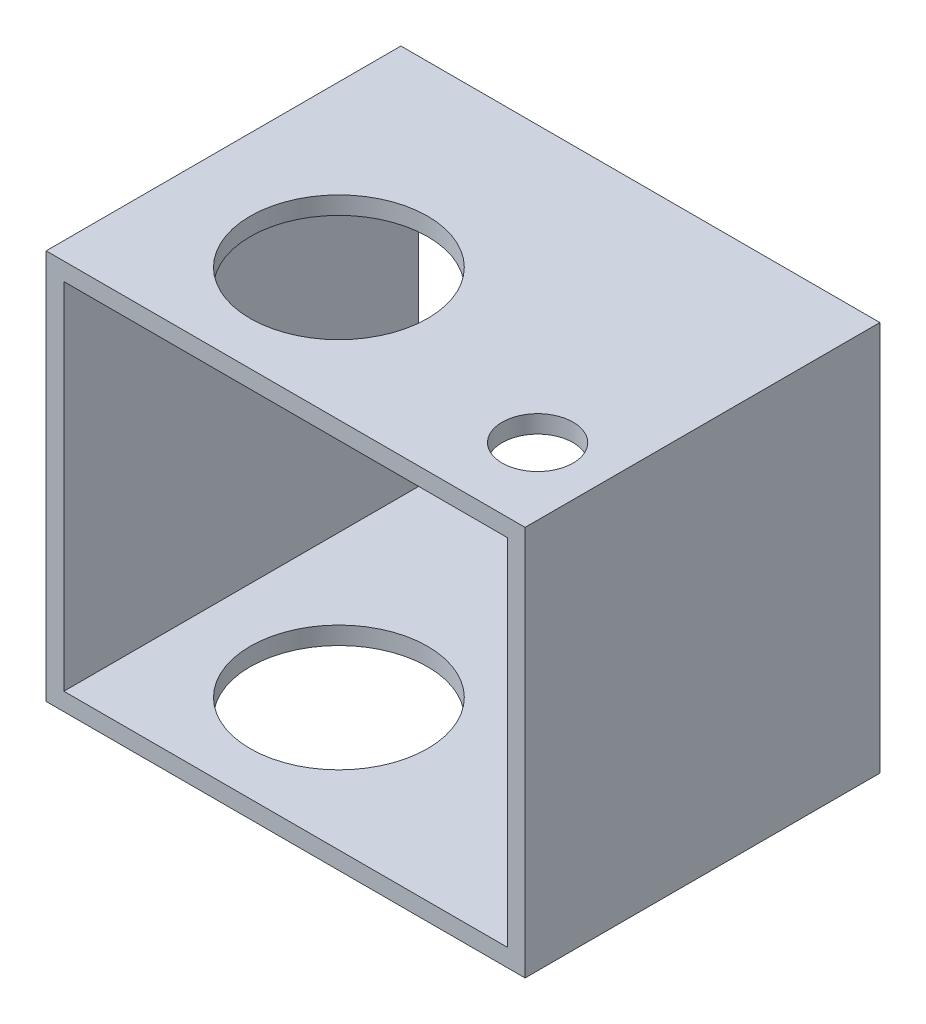
ISO-10303-21;
HEADER;
FILE_DESCRIPTION(('STEP AP214'),'2;1');
FILE_NAME('part.step','',(''),(''),'','','');
FILE_SCHEMA(('AUTOMOTIVE_DESIGN { 1 0 10303 214 1 1 1 1 }'));
ENDSEC;
DATA;
#1=APPLICATION_CONTEXT('core data for automotive mechanical design processes');
#2=APPLICATION_PROTOCOL_DEFINITION('international standard','automotive_design',2000,#1);
#3=PRODUCT_CONTEXT('',#1,'mechanical');
#4=PRODUCT('Part','Part','',(#3));
#5=PRODUCT_RELATED_PRODUCT_CATEGORY('part','',(#4));
#6=PRODUCT_DEFINITION_FORMATION('','',#4);
#7=PRODUCT_DEFINITION_CONTEXT('part definition',#1,'design');
#8=PRODUCT_DEFINITION('design','',#6,#7);
#9=PRODUCT_DEFINITION_SHAPE('','',#8);
#10=(LENGTH_UNIT() NAMED_UNIT(*) SI_UNIT(.MILLI.,.METRE.));
#11=(NAMED_UNIT(*) PLANE_ANGLE_UNIT() SI_UNIT($,.RADIAN.));
#12=(NAMED_UNIT(*) SI_UNIT($,.STERADIAN.) SOLID_ANGLE_UNIT());
#13=UNCERTAINTY_MEASURE_WITH_UNIT(LENGTH_MEASURE(1.E-05),#10,'distance_accuracy_value','');
#14=(GEOMETRIC_REPRESENTATION_CONTEXT(3) GLOBAL_UNCERTAINTY_ASSIGNED_CONTEXT((#13)) GLOBAL_UNIT_ASSIGNED_CONTEXT((#10,
#11,#12)) REPRESENTATION_CONTEXT('',''));
#15=CARTESIAN_POINT('',(0.,0.,0.));
#16=DIRECTION('',(0.,0.,1.));
#17=DIRECTION('',(1.,0.,0.));
#18=AXIS2_PLACEMENT_3D('',#15,#16,#17);
#19=CARTESIAN_POINT('',(0.,0.,20.));
#20=DIRECTION('',(0.,0.,1.));
#21=DIRECTION('',(1.,0.,0.));
#22=AXIS2_PLACEMENT_3D('',#19,#20,#21);
#23=PLANE('',#22);
#24=DIRECTION('',(0.,1.,0.));
#25=VECTOR('',#24,1.);
#26=CARTESIAN_POINT('',(1.,0.,20.));
#27=LINE('',#26,#25);
#28=CARTESIAN_POINT('',(1.,-1.,20.));
#29=VERTEX_POINT('',#28);
#30=CARTESIAN_POINT('',(1.,21.,20.));
#31=VERTEX_POINT('',#30);
#32=EDGE_CURVE('E162',#29,#31,#27,.T.);
#33=ORIENTED_EDGE('',*,*,#32,.T.);
#34=DIRECTION('',(-1.,0.,0.));
#35=VECTOR('',#34,1.);
#36=CARTESIAN_POINT('',(0.,21.,20.));
#37=LINE('',#36,#35);
#38=CARTESIAN_POINT('',(-26.,21.,20.));
#39=VERTEX_POINT('',#38);
#40=EDGE_CURVE('E165',#31,#39,#37,.T.);
#41=ORIENTED_EDGE('',*,*,#40,.T.);
#42=DIRECTION('',(0.,-1.,0.));
#43=VECTOR('',#42,1.);
#44=CARTESIAN_POINT('',(-26.,0.,20.));
#45=LINE('',#44,#43);
#46=CARTESIAN_POINT('',(-26.,-1.,20.));
#47=VERTEX_POINT('',#46);
#48=EDGE_CURVE('E168',#39,#47,#45,.T.);
#49=ORIENTED_EDGE('',*,*,#48,.T.);
#50=DIRECTION('',(1.,0.,0.));
#51=VECTOR('',#50,1.);
#52=CARTESIAN_POINT('',(0.,-1.,20.));
#53=LINE('',#52,#51);
#54=EDGE_CURVE('E170',#47,#29,#53,.T.);
#55=ORIENTED_EDGE('',*,*,#54,.T.);
#56=EDGE_LOOP('',(#33,#41,#49,#55));
#57=FACE_BOUND('',#56,.T.);
#58=DIRECTION('',(-1.,0.,0.));
#59=VECTOR('',#58,1.);
#60=CARTESIAN_POINT('',(0.,20.,20.));
#61=LINE('',#60,#59);
#62=CARTESIAN_POINT('',(0.,20.,20.));
#63=VERTEX_POINT('',#62);
#64=CARTESIAN_POINT('',(-25.,20.,20.));
#65=VERTEX_POINT('',#64);
#66=EDGE_CURVE('E132',#63,#65,#61,.T.);
#67=ORIENTED_EDGE('',*,*,#66,.F.);
#68=DIRECTION('',(0.,1.,0.));
#69=VECTOR('',#68,1.);
#70=CARTESIAN_POINT('',(0.,0.,20.));
#71=LINE('',#70,#69);
#72=CARTESIAN_POINT('',(0.,0.,20.));
#73=VERTEX_POINT('',#72);
#74=EDGE_CURVE('E124',#73,#63,#71,.T.);
#75=ORIENTED_EDGE('',*,*,#74,.F.);
#76=DIRECTION('',(1.,0.,0.));
#77=VECTOR('',#76,1.);
#78=CARTESIAN_POINT('',(0.,0.,20.));
#79=LINE('',#78,#77);
#80=CARTESIAN_POINT('',(-25.,0.,20.));
#81=VERTEX_POINT('',#80);
#82=EDGE_CURVE('E146',#81,#73,#79,.T.);
#83=ORIENTED_EDGE('',*,*,#82,.F.);
#84=DIRECTION('',(0.,-1.,0.));
#85=VECTOR('',#84,1.);
#86=CARTESIAN_POINT('',(-25.,0.,20.));
#87=LINE('',#86,#85);
#88=EDGE_CURVE('E144',#65,#81,#87,.T.);
#89=ORIENTED_EDGE('',*,*,#88,.F.);
#90=EDGE_LOOP('',(#67,#75,#83,#89));
#91=FACE_BOUND('',#90,.T.);
#92=ADVANCED_FACE('F57',(#57,#91),#23,.T.);
#93=CARTESIAN_POINT('',(0.,0.,0.));
#94=DIRECTION('',(0.,0.,1.));
#95=DIRECTION('',(1.,0.,0.));
#96=AXIS2_PLACEMENT_3D('',#93,#94,#95);
#97=PLANE('',#96);
#98=DIRECTION('',(0.,1.,0.));
#99=VECTOR('',#98,1.);
#100=CARTESIAN_POINT('',(1.,0.,0.));
#101=LINE('',#100,#99);
#102=CARTESIAN_POINT('',(1.,-1.,0.));
#103=VERTEX_POINT('',#102);
#104=CARTESIAN_POINT('',(1.,21.,0.));
#105=VERTEX_POINT('',#104);
#106=EDGE_CURVE('E140',#103,#105,#101,.T.);
#107=ORIENTED_EDGE('',*,*,#106,.F.);
#108=DIRECTION('',(1.,0.,0.));
#109=VECTOR('',#108,1.);
#110=CARTESIAN_POINT('',(0.,-1.,0.));
#111=LINE('',#110,#109);
#112=CARTESIAN_POINT('',(-26.,-1.,0.));
#113=VERTEX_POINT('',#112);
#114=EDGE_CURVE('E166',#113,#103,#111,.T.);
#115=ORIENTED_EDGE('',*,*,#114,.F.);
#116=DIRECTION('',(0.,-1.,0.));
#117=VECTOR('',#116,1.);
#118=CARTESIAN_POINT('',(-26.,0.,0.));
#119=LINE('',#118,#117);
#120=CARTESIAN_POINT('',(-26.,21.,0.));
#121=VERTEX_POINT('',#120);
#122=EDGE_CURVE('E177',#121,#113,#119,.T.);
#123=ORIENTED_EDGE('',*,*,#122,.F.);
#124=DIRECTION('',(-1.,0.,0.));
#125=VECTOR('',#124,1.);
#126=CARTESIAN_POINT('',(0.,21.,0.));
#127=LINE('',#126,#125);
#128=EDGE_CURVE('E175',#105,#121,#127,.T.);
#129=ORIENTED_EDGE('',*,*,#128,.F.);
#130=EDGE_LOOP('',(#107,#115,#123,#129));
#131=FACE_BOUND('',#130,.T.);
#132=DIRECTION('',(0.,1.,0.));
#133=VECTOR('',#132,1.);
#134=CARTESIAN_POINT('',(0.,0.,0.));
#135=LINE('',#134,#133);
#136=CARTESIAN_POINT('',(0.,0.,0.));
#137=VERTEX_POINT('',#136);
#138=CARTESIAN_POINT('',(0.,20.,0.));
#139=VERTEX_POINT('',#138);
#140=EDGE_CURVE('E82',#137,#139,#135,.T.);
#141=ORIENTED_EDGE('',*,*,#140,.T.);
#142=DIRECTION('',(-1.,0.,0.));
#143=VECTOR('',#142,1.);
#144=CARTESIAN_POINT('',(0.,20.,0.));
#145=LINE('',#144,#143);
#146=CARTESIAN_POINT('',(-25.,20.,0.));
#147=VERTEX_POINT('',#146);
#148=EDGE_CURVE('E139',#139,#147,#145,.T.);
#149=ORIENTED_EDGE('',*,*,#148,.T.);
#150=DIRECTION('',(0.,-1.,0.));
#151=VECTOR('',#150,1.);
#152=CARTESIAN_POINT('',(-25.,0.,0.));
#153=LINE('',#152,#151);
#154=CARTESIAN_POINT('',(-25.,0.,0.));
#155=VERTEX_POINT('',#154);
#156=EDGE_CURVE('E154',#147,#155,#153,.T.);
#157=ORIENTED_EDGE('',*,*,#156,.T.);
#158=DIRECTION('',(1.,0.,0.));
#159=VECTOR('',#158,1.);
#160=CARTESIAN_POINT('',(0.,0.,0.));
#161=LINE('',#160,#159);
#162=EDGE_CURVE('E133',#155,#137,#161,.T.);
#163=ORIENTED_EDGE('',*,*,#162,.T.);
#164=EDGE_LOOP('',(#141,#149,#157,#163));
#165=FACE_BOUND('',#164,.T.);
#166=ADVANCED_FACE('F236',(#131,#165),#97,.F.);
#167=CARTESIAN_POINT('',(1.,0.,20.));
#168=DIRECTION('',(-1.,0.,0.));
#169=DIRECTION('',(0.,0.,1.));
#170=AXIS2_PLACEMENT_3D('',#167,#168,#169);
#171=PLANE('',#170);
#172=ORIENTED_EDGE('',*,*,#106,.T.);
#173=DIRECTION('',(0.,0.,-1.));
#174=VECTOR('',#173,1.);
#175=CARTESIAN_POINT('',(1.,21.,20.));
#176=LINE('',#175,#174);
#177=EDGE_CURVE('E12',#31,#105,#176,.T.);
#178=ORIENTED_EDGE('',*,*,#177,.F.);
#179=ORIENTED_EDGE('',*,*,#32,.F.);
#180=DIRECTION('',(0.,0.,-1.));
#181=VECTOR('',#180,1.);
#182=CARTESIAN_POINT('',(1.,-1.,20.));
#183=LINE('',#182,#181);
#184=EDGE_CURVE('E172',#29,#103,#183,.T.);
#185=ORIENTED_EDGE('',*,*,#184,.T.);
#186=EDGE_LOOP('',(#172,#178,#179,#185));
#187=FACE_BOUND('',#186,.T.);
#188=ADVANCED_FACE('F59',(#187),#171,.F.);
#189=CARTESIAN_POINT('',(0.,21.,20.));
#190=DIRECTION('',(0.,-1.,0.));
#191=DIRECTION('',(1.,0.,0.));
#192=AXIS2_PLACEMENT_3D('',#189,#190,#191);
#193=PLANE('',#192);
#194=CARTESIAN_POINT('',(-2.78489642997926,21.,15.5087196353438));
#195=DIRECTION('',(0.,1.,0.));
#196=DIRECTION('',(-1.,0.,0.));
#197=AXIS2_PLACEMENT_3D('',#194,#195,#196);
#198=CIRCLE('',#197,2.);
#199=CARTESIAN_POINT('',(-4.78489642997926,21.,15.5087196353438));
#200=VERTEX_POINT('',#199);
#201=EDGE_CURVE('E200',#200,#200,#198,.T.);
#202=ORIENTED_EDGE('',*,*,#201,.F.);
#203=EDGE_LOOP('',(#202));
#204=FACE_BOUND('',#203,.T.);
#205=CARTESIAN_POINT('',(-16.9444338680746,21.,12.5518280582246));
#206=DIRECTION('',(0.,1.,0.));
#207=DIRECTION('',(-1.,0.,0.));
#208=AXIS2_PLACEMENT_3D('',#205,#206,#207);
#209=CIRCLE('',#208,5.);
#210=CARTESIAN_POINT('',(-21.9444338680746,21.,12.5518280582246));
#211=VERTEX_POINT('',#210);
#212=EDGE_CURVE('E193',#211,#211,#209,.T.);
#213=ORIENTED_EDGE('',*,*,#212,.F.);
#214=EDGE_LOOP('',(#213));
#215=FACE_BOUND('',#214,.T.);
#216=ORIENTED_EDGE('',*,*,#128,.T.);
#217=DIRECTION('',(0.,0.,-1.));
#218=VECTOR('',#217,1.);
#219=CARTESIAN_POINT('',(-26.,21.,20.));
#220=LINE('',#219,#218);
#221=EDGE_CURVE('E66',#39,#121,#220,.T.);
#222=ORIENTED_EDGE('',*,*,#221,.F.);
#223=ORIENTED_EDGE('',*,*,#40,.F.);
#224=ORIENTED_EDGE('',*,*,#177,.T.);
#225=EDGE_LOOP('',(#216,#222,#223,#224));
#226=FACE_BOUND('',#225,.T.);
#227=ADVANCED_FACE('F222',(#204,#215,#226),#193,.F.);
#228=CARTESIAN_POINT('',(-26.,0.,20.));
#229=DIRECTION('',(1.,0.,0.));
#230=DIRECTION('',(0.,0.,-1.));
#231=AXIS2_PLACEMENT_3D('',#228,#229,#230);
#232=PLANE('',#231);
#233=ORIENTED_EDGE('',*,*,#122,.T.);
#234=DIRECTION('',(0.,0.,-1.));
#235=VECTOR('',#234,1.);
#236=CARTESIAN_POINT('',(-26.,-1.,20.));
#237=LINE('',#236,#235);
#238=EDGE_CURVE('E182',#47,#113,#237,.T.);
#239=ORIENTED_EDGE('',*,*,#238,.F.);
#240=ORIENTED_EDGE('',*,*,#48,.F.);
#241=ORIENTED_EDGE('',*,*,#221,.T.);
#242=EDGE_LOOP('',(#233,#239,#240,#241));
#243=FACE_BOUND('',#242,.T.);
#244=ADVANCED_FACE('F225',(#243),#232,.F.);
#245=CARTESIAN_POINT('',(0.,-1.,20.));
#246=DIRECTION('',(0.,1.,0.));
#247=DIRECTION('',(-1.,0.,0.));
#248=AXIS2_PLACEMENT_3D('',#245,#246,#247);
#249=PLANE('',#248);
#250=CARTESIAN_POINT('',(-16.9444338680746,-1.00000000000001,12.5518280582246));
#251=DIRECTION('',(0.,1.,0.));
#252=DIRECTION('',(-1.,0.,0.));
#253=AXIS2_PLACEMENT_3D('',#250,#251,#252);
#254=CIRCLE('',#253,5.);
#255=CARTESIAN_POINT('',(-21.9444338680746,-1.00000000000001,12.5518280582246));
#256=VERTEX_POINT('',#255);
#257=EDGE_CURVE('E188',#256,#256,#254,.T.);
#258=ORIENTED_EDGE('',*,*,#257,.T.);
#259=EDGE_LOOP('',(#258));
#260=FACE_BOUND('',#259,.T.);
#261=ORIENTED_EDGE('',*,*,#114,.T.);
#262=ORIENTED_EDGE('',*,*,#184,.F.);
#263=ORIENTED_EDGE('',*,*,#54,.F.);
#264=ORIENTED_EDGE('',*,*,#238,.T.);
#265=EDGE_LOOP('',(#261,#262,#263,#264));
#266=FACE_BOUND('',#265,.T.);
#267=ADVANCED_FACE('F240',(#260,#266),#249,.F.);
#268=CARTESIAN_POINT('',(0.,0.,20.));
#269=DIRECTION('',(-1.,0.,0.));
#270=DIRECTION('',(0.,0.,1.));
#271=AXIS2_PLACEMENT_3D('',#268,#269,#270);
#272=PLANE('',#271);
#273=ORIENTED_EDGE('',*,*,#140,.F.);
#274=DIRECTION('',(0.,0.,-1.));
#275=VECTOR('',#274,1.);
#276=CARTESIAN_POINT('',(0.,0.,20.));
#277=LINE('',#276,#275);
#278=EDGE_CURVE('E128',#73,#137,#277,.T.);
#279=ORIENTED_EDGE('',*,*,#278,.F.);
#280=ORIENTED_EDGE('',*,*,#74,.T.);
#281=DIRECTION('',(0.,0.,-1.));
#282=VECTOR('',#281,1.);
#283=CARTESIAN_POINT('',(0.,20.,20.));
#284=LINE('',#283,#282);
#285=EDGE_CURVE('E127',#63,#139,#284,.T.);
#286=ORIENTED_EDGE('',*,*,#285,.T.);
#287=EDGE_LOOP('',(#273,#279,#280,#286));
#288=FACE_BOUND('',#287,.T.);
#289=ADVANCED_FACE('F126',(#288),#272,.T.);
#290=CARTESIAN_POINT('',(0.,20.,20.));
#291=DIRECTION('',(0.,-1.,0.));
#292=DIRECTION('',(1.,0.,0.));
#293=AXIS2_PLACEMENT_3D('',#290,#291,#292);
#294=PLANE('',#293);
#295=CARTESIAN_POINT('',(-2.78489642997926,20.,15.5087196353438));
#296=DIRECTION('',(0.,-1.,0.));
#297=DIRECTION('',(1.,0.,0.));
#298=AXIS2_PLACEMENT_3D('',#295,#296,#297);
#299=CIRCLE('',#298,2.);
#300=CARTESIAN_POINT('',(-0.784896429979261,20.,15.5087196353438));
#301=VERTEX_POINT('',#300);
#302=EDGE_CURVE('E61',#301,#301,#299,.T.);
#303=ORIENTED_EDGE('',*,*,#302,.F.);
#304=EDGE_LOOP('',(#303));
#305=FACE_BOUND('',#304,.T.);
#306=CARTESIAN_POINT('',(-16.9444338680746,20.,12.5518280582246));
#307=DIRECTION('',(0.,-1.,0.));
#308=DIRECTION('',(1.,0.,0.));
#309=AXIS2_PLACEMENT_3D('',#306,#307,#308);
#310=CIRCLE('',#309,5.);
#311=CARTESIAN_POINT('',(-11.9444338680746,20.,12.5518280582246));
#312=VERTEX_POINT('',#311);
#313=EDGE_CURVE('E152',#312,#312,#310,.T.);
#314=ORIENTED_EDGE('',*,*,#313,.F.);
#315=EDGE_LOOP('',(#314));
#316=FACE_BOUND('',#315,.T.);
#317=ORIENTED_EDGE('',*,*,#148,.F.);
#318=ORIENTED_EDGE('',*,*,#285,.F.);
#319=ORIENTED_EDGE('',*,*,#66,.T.);
#320=DIRECTION('',(0.,0.,-1.));
#321=VECTOR('',#320,1.);
#322=CARTESIAN_POINT('',(-25.,20.,20.));
#323=LINE('',#322,#321);
#324=EDGE_CURVE('E141',#65,#147,#323,.T.);
#325=ORIENTED_EDGE('',*,*,#324,.T.);
#326=EDGE_LOOP('',(#317,#318,#319,#325));
#327=FACE_BOUND('',#326,.T.);
#328=ADVANCED_FACE('F136',(#305,#316,#327),#294,.T.);
#329=CARTESIAN_POINT('',(-25.,0.,20.));
#330=DIRECTION('',(1.,0.,0.));
#331=DIRECTION('',(0.,0.,-1.));
#332=AXIS2_PLACEMENT_3D('',#329,#330,#331);
#333=PLANE('',#332);
#334=ORIENTED_EDGE('',*,*,#156,.F.);
#335=ORIENTED_EDGE('',*,*,#324,.F.);
#336=ORIENTED_EDGE('',*,*,#88,.T.);
#337=DIRECTION('',(0.,0.,-1.));
#338=VECTOR('',#337,1.);
#339=CARTESIAN_POINT('',(-25.,0.,20.));
#340=LINE('',#339,#338);
#341=EDGE_CURVE('E74',#81,#155,#340,.T.);
#342=ORIENTED_EDGE('',*,*,#341,.T.);
#343=EDGE_LOOP('',(#334,#335,#336,#342));
#344=FACE_BOUND('',#343,.T.);
#345=ADVANCED_FACE('F211',(#344),#333,.T.);
#346=CARTESIAN_POINT('',(0.,0.,20.));
#347=DIRECTION('',(0.,1.,0.));
#348=DIRECTION('',(-1.,0.,0.));
#349=AXIS2_PLACEMENT_3D('',#346,#347,#348);
#350=PLANE('',#349);
#351=CARTESIAN_POINT('',(-16.9444338680746,0.,12.5518280582246));
#352=DIRECTION('',(0.,1.,0.));
#353=DIRECTION('',(-1.,0.,0.));
#354=AXIS2_PLACEMENT_3D('',#351,#352,#353);
#355=CIRCLE('',#354,5.);
#356=CARTESIAN_POINT('',(-21.9444338680746,0.,12.5518280582246));
#357=VERTEX_POINT('',#356);
#358=EDGE_CURVE('E186',#357,#357,#355,.T.);
#359=ORIENTED_EDGE('',*,*,#358,.F.);
#360=EDGE_LOOP('',(#359));
#361=FACE_BOUND('',#360,.T.);
#362=ORIENTED_EDGE('',*,*,#162,.F.);
#363=ORIENTED_EDGE('',*,*,#341,.F.);
#364=ORIENTED_EDGE('',*,*,#82,.T.);
#365=ORIENTED_EDGE('',*,*,#278,.T.);
#366=EDGE_LOOP('',(#362,#363,#364,#365));
#367=FACE_BOUND('',#366,.T.);
#368=ADVANCED_FACE('F287',(#361,#367),#350,.T.);
#369=CARTESIAN_POINT('',(-16.9444338680746,-1.00000000000001,12.5518280582246));
#370=DIRECTION('',(0.,1.,0.));
#371=DIRECTION('',(-1.,0.,0.));
#372=AXIS2_PLACEMENT_3D('',#369,#370,#371);
#373=CYLINDRICAL_SURFACE('',#372,5.);
#374=ORIENTED_EDGE('',*,*,#358,.T.);
#375=EDGE_LOOP('',(#374));
#376=FACE_BOUND('',#375,.T.);
#377=ORIENTED_EDGE('',*,*,#257,.F.);
#378=EDGE_LOOP('',(#377));
#379=FACE_BOUND('',#378,.T.);
#380=ADVANCED_FACE('F218',(#376,#379),#373,.F.);
#381=ORIENTED_EDGE('',*,*,#313,.T.);
#382=EDGE_LOOP('',(#381));
#383=FACE_BOUND('',#382,.T.);
#384=ORIENTED_EDGE('',*,*,#212,.T.);
#385=EDGE_LOOP('',(#384));
#386=FACE_BOUND('',#385,.T.);
#387=ADVANCED_FACE('F215',(#383,#386),#373,.F.);
#388=CARTESIAN_POINT('',(-2.78489642997926,11.,15.5087196353438));
#389=DIRECTION('',(0.,1.,0.));
#390=DIRECTION('',(-1.,0.,0.));
#391=AXIS2_PLACEMENT_3D('',#388,#389,#390);
#392=CYLINDRICAL_SURFACE('',#391,2.);
#393=ORIENTED_EDGE('',*,*,#302,.T.);
#394=EDGE_LOOP('',(#393));
#395=FACE_BOUND('',#394,.T.);
#396=ORIENTED_EDGE('',*,*,#201,.T.);
#397=EDGE_LOOP('',(#396));
#398=FACE_BOUND('',#397,.T.);
#399=ADVANCED_FACE('F207',(#395,#398),#392,.F.);
#400=CLOSED_SHELL('',(#92,#166,#188,#227,#244,#267,#289,#328,#345,#368,#380,#387,#399));
#401=MANIFOLD_SOLID_BREP('B2',#400);
#402=ADVANCED_BREP_SHAPE_REPRESENTATION('',(#18,#401),#14);
#403=SHAPE_DEFINITION_REPRESENTATION(#9,#402);
ENDSEC;
END-ISO-10303-21;
